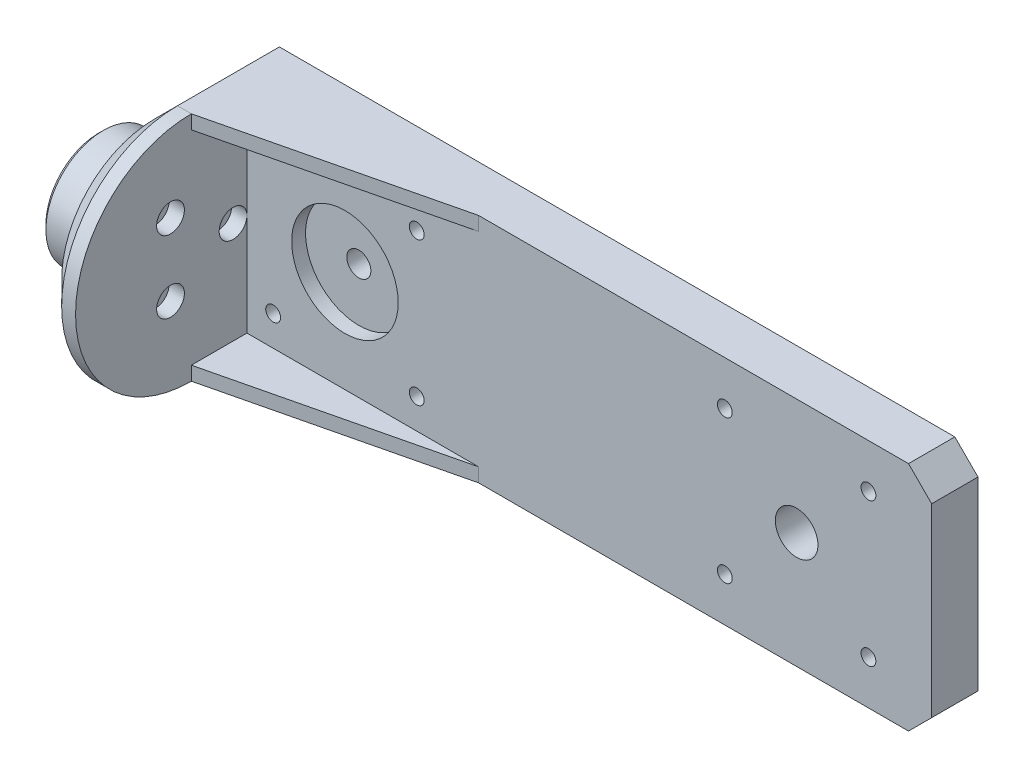
ISO-10303-21;
HEADER;
FILE_DESCRIPTION(('STEP AP214'),'2;1');
FILE_NAME('part.step','',(''),(''),'','','');
FILE_SCHEMA(('AUTOMOTIVE_DESIGN { 1 0 10303 214 1 1 1 1 }'));
ENDSEC;
DATA;
#1=APPLICATION_CONTEXT('core data for automotive mechanical design processes');
#2=APPLICATION_PROTOCOL_DEFINITION('international standard','automotive_design',2000,#1);
#3=PRODUCT_CONTEXT('',#1,'mechanical');
#4=PRODUCT('Part','Part','',(#3));
#5=PRODUCT_RELATED_PRODUCT_CATEGORY('part','',(#4));
#6=PRODUCT_DEFINITION_FORMATION('','',#4);
#7=PRODUCT_DEFINITION_CONTEXT('part definition',#1,'design');
#8=PRODUCT_DEFINITION('design','',#6,#7);
#9=PRODUCT_DEFINITION_SHAPE('','',#8);
#10=(LENGTH_UNIT() NAMED_UNIT(*) SI_UNIT(.MILLI.,.METRE.));
#11=(NAMED_UNIT(*) PLANE_ANGLE_UNIT() SI_UNIT($,.RADIAN.));
#12=(NAMED_UNIT(*) SI_UNIT($,.STERADIAN.) SOLID_ANGLE_UNIT());
#13=UNCERTAINTY_MEASURE_WITH_UNIT(LENGTH_MEASURE(1.E-05),#10,'distance_accuracy_value','');
#14=(GEOMETRIC_REPRESENTATION_CONTEXT(3) GLOBAL_UNCERTAINTY_ASSIGNED_CONTEXT((#13)) GLOBAL_UNIT_ASSIGNED_CONTEXT((#10,
#11,#12)) REPRESENTATION_CONTEXT('',''));
#15=CARTESIAN_POINT('',(0.,0.,0.));
#16=DIRECTION('',(0.,0.,1.));
#17=DIRECTION('',(1.,0.,0.));
#18=AXIS2_PLACEMENT_3D('',#15,#16,#17);
#19=CARTESIAN_POINT('',(41.1500000000002,0.,-22.));
#20=DIRECTION('',(0.,0.,1.));
#21=DIRECTION('',(1.,0.,0.));
#22=AXIS2_PLACEMENT_3D('',#19,#20,#21);
#23=CYLINDRICAL_SURFACE('',#22,2.6);
#24=CARTESIAN_POINT('',(41.1500000000002,0.,-22.));
#25=DIRECTION('',(0.,0.,1.));
#26=DIRECTION('',(1.,0.,0.));
#27=AXIS2_PLACEMENT_3D('',#24,#25,#26);
#28=CIRCLE('',#27,2.6);
#29=CARTESIAN_POINT('',(43.7500000000002,0.,-22.));
#30=VERTEX_POINT('',#29);
#31=EDGE_CURVE('E225',#30,#30,#28,.T.);
#32=ORIENTED_EDGE('',*,*,#31,.F.);
#33=EDGE_LOOP('',(#32));
#34=FACE_BOUND('',#33,.T.);
#35=CARTESIAN_POINT('',(41.1500000000002,0.,-15.));
#36=DIRECTION('',(0.,0.,1.));
#37=DIRECTION('',(1.,0.,0.));
#38=AXIS2_PLACEMENT_3D('',#35,#36,#37);
#39=CIRCLE('',#38,2.6);
#40=CARTESIAN_POINT('',(43.7500000000002,0.,-15.));
#41=VERTEX_POINT('',#40);
#42=EDGE_CURVE('E195',#41,#41,#39,.F.);
#43=ORIENTED_EDGE('',*,*,#42,.F.);
#44=EDGE_LOOP('',(#43));
#45=FACE_BOUND('',#44,.T.);
#46=ADVANCED_FACE('F41',(#34,#45),#23,.F.);
#47=CARTESIAN_POINT('',(20.,0.,-9.00000000000001));
#48=DIRECTION('',(-1.,0.,0.));
#49=DIRECTION('',(0.,0.,1.));
#50=AXIS2_PLACEMENT_3D('',#47,#48,#49);
#51=CYLINDRICAL_SURFACE('',#50,1.59999999999999);
#52=CARTESIAN_POINT('',(0.,0.,-9.00000000000001));
#53=DIRECTION('',(1.,0.,0.));
#54=DIRECTION('',(0.,0.,-1.));
#55=AXIS2_PLACEMENT_3D('',#52,#53,#54);
#56=CIRCLE('',#55,1.59999999999999);
#57=CARTESIAN_POINT('',(0.,0.,-10.6));
#58=VERTEX_POINT('',#57);
#59=EDGE_CURVE('E311',#58,#58,#56,.T.);
#60=ORIENTED_EDGE('',*,*,#59,.F.);
#61=EDGE_LOOP('',(#60));
#62=FACE_BOUND('',#61,.T.);
#63=CARTESIAN_POINT('',(16.7,0.,-9.00000000000001));
#64=DIRECTION('',(1.,0.,0.));
#65=DIRECTION('',(0.,0.,-1.));
#66=AXIS2_PLACEMENT_3D('',#63,#64,#65);
#67=CIRCLE('',#66,1.59999999999999);
#68=CARTESIAN_POINT('',(16.7,0.,-10.6));
#69=VERTEX_POINT('',#68);
#70=EDGE_CURVE('E224',#69,#69,#67,.T.);
#71=ORIENTED_EDGE('',*,*,#70,.T.);
#72=EDGE_LOOP('',(#71));
#73=FACE_BOUND('',#72,.T.);
#74=ADVANCED_FACE('F373',(#62,#73),#51,.F.);
#75=CARTESIAN_POINT('',(20.,-7.79422863405993,4.50000000000004));
#76=DIRECTION('',(-1.,0.,0.));
#77=DIRECTION('',(0.,0.,1.));
#78=AXIS2_PLACEMENT_3D('',#75,#76,#77);
#79=CYLINDRICAL_SURFACE('',#78,1.6);
#80=CARTESIAN_POINT('',(0.,-7.79422863405993,4.50000000000004));
#81=DIRECTION('',(1.,0.,0.));
#82=DIRECTION('',(0.,0.,-1.));
#83=AXIS2_PLACEMENT_3D('',#80,#81,#82);
#84=CIRCLE('',#83,1.6);
#85=CARTESIAN_POINT('',(0.,-7.79422863405993,2.90000000000004));
#86=VERTEX_POINT('',#85);
#87=EDGE_CURVE('E308',#86,#86,#84,.T.);
#88=ORIENTED_EDGE('',*,*,#87,.F.);
#89=EDGE_LOOP('',(#88));
#90=FACE_BOUND('',#89,.T.);
#91=CARTESIAN_POINT('',(16.7,-7.79422863405993,4.50000000000004));
#92=DIRECTION('',(1.,0.,0.));
#93=DIRECTION('',(0.,0.,-1.));
#94=AXIS2_PLACEMENT_3D('',#91,#92,#93);
#95=CIRCLE('',#94,1.6);
#96=CARTESIAN_POINT('',(16.7,-7.79422863405993,2.90000000000004));
#97=VERTEX_POINT('',#96);
#98=EDGE_CURVE('E317',#97,#97,#95,.T.);
#99=ORIENTED_EDGE('',*,*,#98,.T.);
#100=EDGE_LOOP('',(#99));
#101=FACE_BOUND('',#100,.T.);
#102=ADVANCED_FACE('F379',(#90,#101),#79,.F.);
#103=CARTESIAN_POINT('',(20.,7.79422863406,4.49999999999993));
#104=DIRECTION('',(-1.,0.,0.));
#105=DIRECTION('',(0.,0.,1.));
#106=AXIS2_PLACEMENT_3D('',#103,#104,#105);
#107=CYLINDRICAL_SURFACE('',#106,1.6);
#108=CARTESIAN_POINT('',(0.,7.79422863406,4.49999999999993));
#109=DIRECTION('',(1.,0.,0.));
#110=DIRECTION('',(0.,0.,-1.));
#111=AXIS2_PLACEMENT_3D('',#108,#109,#110);
#112=CIRCLE('',#111,1.6);
#113=CARTESIAN_POINT('',(0.,7.79422863406,2.89999999999993));
#114=VERTEX_POINT('',#113);
#115=EDGE_CURVE('E304',#114,#114,#112,.T.);
#116=ORIENTED_EDGE('',*,*,#115,.F.);
#117=EDGE_LOOP('',(#116));
#118=FACE_BOUND('',#117,.T.);
#119=CARTESIAN_POINT('',(16.7,7.79422863406,4.49999999999993));
#120=DIRECTION('',(1.,0.,0.));
#121=DIRECTION('',(0.,0.,-1.));
#122=AXIS2_PLACEMENT_3D('',#119,#120,#121);
#123=CIRCLE('',#122,1.6);
#124=CARTESIAN_POINT('',(16.7,7.79422863406,2.89999999999993));
#125=VERTEX_POINT('',#124);
#126=EDGE_CURVE('E201',#125,#125,#123,.T.);
#127=ORIENTED_EDGE('',*,*,#126,.T.);
#128=EDGE_LOOP('',(#127));
#129=FACE_BOUND('',#128,.T.);
#130=ADVANCED_FACE('F450',(#118,#129),#107,.F.);
#131=CARTESIAN_POINT('',(20.,0.,0.));
#132=DIRECTION('',(-1.,0.,0.));
#133=DIRECTION('',(0.,0.,1.));
#134=AXIS2_PLACEMENT_3D('',#131,#132,#133);
#135=CYLINDRICAL_SURFACE('',#134,12.4);
#136=CARTESIAN_POINT('',(0.99999999999999,0.,0.));
#137=DIRECTION('',(1.,0.,0.));
#138=DIRECTION('',(0.,0.,-1.));
#139=AXIS2_PLACEMENT_3D('',#136,#137,#138);
#140=CIRCLE('',#139,12.4);
#141=CARTESIAN_POINT('',(0.99999999999999,0.,-12.4));
#142=VERTEX_POINT('',#141);
#143=EDGE_CURVE('E50',#142,#142,#140,.T.);
#144=ORIENTED_EDGE('',*,*,#143,.T.);
#145=EDGE_LOOP('',(#144));
#146=FACE_BOUND('',#145,.T.);
#147=CARTESIAN_POINT('',(12.,0.,0.));
#148=DIRECTION('',(1.,0.,0.));
#149=DIRECTION('',(0.,0.,-1.));
#150=AXIS2_PLACEMENT_3D('',#147,#148,#149);
#151=CIRCLE('',#150,12.4);
#152=CARTESIAN_POINT('',(12.,0.,-12.4));
#153=VERTEX_POINT('',#152);
#154=EDGE_CURVE('E295',#153,#153,#151,.T.);
#155=ORIENTED_EDGE('',*,*,#154,.F.);
#156=EDGE_LOOP('',(#155));
#157=FACE_BOUND('',#156,.T.);
#158=ADVANCED_FACE('F361',(#146,#157),#135,.T.);
#159=CARTESIAN_POINT('',(20.,0.,0.));
#160=DIRECTION('',(1.,0.,0.));
#161=DIRECTION('',(0.,0.,-1.));
#162=AXIS2_PLACEMENT_3D('',#159,#160,#161);
#163=PLANE('',#162);
#164=DIRECTION('',(0.,1.,0.));
#165=VECTOR('',#164,1.);
#166=CARTESIAN_POINT('',(20.,22.,0.));
#167=LINE('',#166,#165);
#168=CARTESIAN_POINT('',(20.,22.,0.));
#169=VERTEX_POINT('',#168);
#170=CARTESIAN_POINT('',(20.,25.,0.));
#171=VERTEX_POINT('',#170);
#172=EDGE_CURVE('E142',#169,#171,#167,.T.);
#173=ORIENTED_EDGE('',*,*,#172,.T.);
#174=CARTESIAN_POINT('',(20.,0.,0.));
#175=DIRECTION('',(1.,0.,0.));
#176=DIRECTION('',(0.,0.,-1.));
#177=AXIS2_PLACEMENT_3D('',#174,#175,#176);
#178=CIRCLE('',#177,25.);
#179=CARTESIAN_POINT('',(20.,-25.,0.));
#180=VERTEX_POINT('',#179);
#181=EDGE_CURVE('E289',#171,#180,#178,.T.);
#182=ORIENTED_EDGE('',*,*,#181,.T.);
#183=DIRECTION('',(0.,-1.,0.));
#184=VECTOR('',#183,1.);
#185=CARTESIAN_POINT('',(20.,-22.,0.));
#186=LINE('',#185,#184);
#187=CARTESIAN_POINT('',(20.,-22.,0.));
#188=VERTEX_POINT('',#187);
#189=EDGE_CURVE('E186',#188,#180,#186,.T.);
#190=ORIENTED_EDGE('',*,*,#189,.F.);
#191=DIRECTION('',(0.,0.,-1.));
#192=VECTOR('',#191,1.);
#193=CARTESIAN_POINT('',(20.,-22.,-12.));
#194=LINE('',#193,#192);
#195=CARTESIAN_POINT('',(20.,-22.,-12.));
#196=VERTEX_POINT('',#195);
#197=EDGE_CURVE('E174',#188,#196,#194,.T.);
#198=ORIENTED_EDGE('',*,*,#197,.T.);
#199=DIRECTION('',(0.,-1.,0.));
#200=VECTOR('',#199,1.);
#201=CARTESIAN_POINT('',(20.,0.,-12.));
#202=LINE('',#201,#200);
#203=CARTESIAN_POINT('',(20.,0.,-12.));
#204=VERTEX_POINT('',#203);
#205=EDGE_CURVE('E300',#204,#196,#202,.T.);
#206=ORIENTED_EDGE('',*,*,#205,.F.);
#207=CARTESIAN_POINT('',(20.,0.,-9.00000000000001));
#208=DIRECTION('',(1.,0.,0.));
#209=DIRECTION('',(0.,0.,-1.));
#210=AXIS2_PLACEMENT_3D('',#207,#208,#209);
#211=CIRCLE('',#210,3.);
#212=EDGE_CURVE('E208',#204,#204,#211,.T.);
#213=ORIENTED_EDGE('',*,*,#212,.F.);
#214=CARTESIAN_POINT('',(20.,22.,-12.));
#215=VERTEX_POINT('',#214);
#216=EDGE_CURVE('E166',#215,#204,#202,.T.);
#217=ORIENTED_EDGE('',*,*,#216,.F.);
#218=DIRECTION('',(0.,0.,1.));
#219=VECTOR('',#218,1.);
#220=CARTESIAN_POINT('',(20.,22.,-12.));
#221=LINE('',#220,#219);
#222=EDGE_CURVE('E158',#215,#169,#221,.T.);
#223=ORIENTED_EDGE('',*,*,#222,.T.);
#224=EDGE_LOOP('',(#173,#182,#190,#198,#206,#213,#217,#223));
#225=FACE_BOUND('',#224,.T.);
#226=CARTESIAN_POINT('',(20.,7.79422863406,4.49999999999993));
#227=DIRECTION('',(1.,0.,0.));
#228=DIRECTION('',(0.,0.,-1.));
#229=AXIS2_PLACEMENT_3D('',#226,#227,#228);
#230=CIRCLE('',#229,3.);
#231=CARTESIAN_POINT('',(20.,7.79422863406,1.49999999999993));
#232=VERTEX_POINT('',#231);
#233=EDGE_CURVE('E202',#232,#232,#230,.T.);
#234=ORIENTED_EDGE('',*,*,#233,.F.);
#235=EDGE_LOOP('',(#234));
#236=FACE_BOUND('',#235,.T.);
#237=CARTESIAN_POINT('',(20.,-7.79422863405993,4.50000000000004));
#238=DIRECTION('',(1.,0.,0.));
#239=DIRECTION('',(0.,0.,-1.));
#240=AXIS2_PLACEMENT_3D('',#237,#238,#239);
#241=CIRCLE('',#240,3.);
#242=CARTESIAN_POINT('',(20.,-7.79422863405993,1.50000000000004));
#243=VERTEX_POINT('',#242);
#244=EDGE_CURVE('E214',#243,#243,#241,.T.);
#245=ORIENTED_EDGE('',*,*,#244,.F.);
#246=EDGE_LOOP('',(#245));
#247=FACE_BOUND('',#246,.T.);
#248=ADVANCED_FACE('F163',(#225,#236,#247),#163,.T.);
#249=CARTESIAN_POINT('',(0.,0.,0.));
#250=DIRECTION('',(1.,0.,0.));
#251=DIRECTION('',(0.,0.,-1.));
#252=AXIS2_PLACEMENT_3D('',#249,#250,#251);
#253=PLANE('',#252);
#254=CARTESIAN_POINT('',(0.,0.,0.));
#255=DIRECTION('',(1.,0.,0.));
#256=DIRECTION('',(0.,0.,-1.));
#257=AXIS2_PLACEMENT_3D('',#254,#255,#256);
#258=CIRCLE('',#257,11.4);
#259=CARTESIAN_POINT('',(0.,0.,-11.4));
#260=VERTEX_POINT('',#259);
#261=EDGE_CURVE('E11',#260,#260,#258,.F.);
#262=ORIENTED_EDGE('',*,*,#261,.T.);
#263=EDGE_LOOP('',(#262));
#264=FACE_BOUND('',#263,.T.);
#265=ORIENTED_EDGE('',*,*,#59,.T.);
#266=EDGE_LOOP('',(#265));
#267=FACE_BOUND('',#266,.T.);
#268=ORIENTED_EDGE('',*,*,#87,.T.);
#269=EDGE_LOOP('',(#268));
#270=FACE_BOUND('',#269,.T.);
#271=ORIENTED_EDGE('',*,*,#115,.T.);
#272=EDGE_LOOP('',(#271));
#273=FACE_BOUND('',#272,.T.);
#274=ADVANCED_FACE('F448',(#264,#267,#270,#273),#253,.F.);
#275=CARTESIAN_POINT('',(12.,25.,0.));
#276=DIRECTION('',(0.,-1.,0.));
#277=DIRECTION('',(0.,0.,-1.));
#278=AXIS2_PLACEMENT_3D('',#275,#276,#277);
#279=PLANE('',#278);
#280=DIRECTION('',(1.,0.,0.));
#281=VECTOR('',#280,1.);
#282=CARTESIAN_POINT('',(12.,25.,-22.));
#283=LINE('',#282,#281);
#284=CARTESIAN_POINT('',(17.,25.,-22.));
#285=VERTEX_POINT('',#284);
#286=CARTESIAN_POINT('',(162.81,25.,-22.));
#287=VERTEX_POINT('',#286);
#288=EDGE_CURVE('E279',#285,#287,#283,.T.);
#289=ORIENTED_EDGE('',*,*,#288,.F.);
#290=DIRECTION('',(0.,0.,1.));
#291=VECTOR('',#290,1.);
#292=CARTESIAN_POINT('',(17.,25.,0.));
#293=LINE('',#292,#291);
#294=CARTESIAN_POINT('',(17.,25.,0.));
#295=VERTEX_POINT('',#294);
#296=EDGE_CURVE('E347',#285,#295,#293,.T.);
#297=ORIENTED_EDGE('',*,*,#296,.T.);
#298=DIRECTION('',(1.,0.,0.));
#299=VECTOR('',#298,1.);
#300=CARTESIAN_POINT('',(12.,25.,0.));
#301=LINE('',#300,#299);
#302=EDGE_CURVE('E298',#295,#171,#301,.T.);
#303=ORIENTED_EDGE('',*,*,#302,.T.);
#304=DIRECTION('',(0.972387301980517,0.,-0.233372952475324));
#305=VECTOR('',#304,1.);
#306=CARTESIAN_POINT('',(20.,25.,0.));
#307=LINE('',#306,#305);
#308=CARTESIAN_POINT('',(69.9999999999999,25.,-12.));
#309=VERTEX_POINT('',#308);
#310=EDGE_CURVE('E148',#171,#309,#307,.T.);
#311=ORIENTED_EDGE('',*,*,#310,.T.);
#312=DIRECTION('',(1.,0.,0.));
#313=VECTOR('',#312,1.);
#314=CARTESIAN_POINT('',(12.,25.,-12.));
#315=LINE('',#314,#313);
#316=CARTESIAN_POINT('',(162.81,25.,-12.));
#317=VERTEX_POINT('',#316);
#318=EDGE_CURVE('E273',#309,#317,#315,.T.);
#319=ORIENTED_EDGE('',*,*,#318,.T.);
#320=DIRECTION('',(0.,0.,-1.));
#321=VECTOR('',#320,1.);
#322=CARTESIAN_POINT('',(162.81,25.,0.));
#323=LINE('',#322,#321);
#324=EDGE_CURVE('E345',#317,#287,#323,.T.);
#325=ORIENTED_EDGE('',*,*,#324,.T.);
#326=EDGE_LOOP('',(#289,#297,#303,#311,#319,#325));
#327=FACE_BOUND('',#326,.T.);
#328=ADVANCED_FACE('F441',(#327),#279,.F.);
#329=CARTESIAN_POINT('',(12.,-25.,0.));
#330=DIRECTION('',(0.,1.,0.));
#331=DIRECTION('',(0.,0.,1.));
#332=AXIS2_PLACEMENT_3D('',#329,#330,#331);
#333=PLANE('',#332);
#334=DIRECTION('',(1.,0.,0.));
#335=VECTOR('',#334,1.);
#336=CARTESIAN_POINT('',(12.,-25.,0.));
#337=LINE('',#336,#335);
#338=CARTESIAN_POINT('',(17.,-25.,0.));
#339=VERTEX_POINT('',#338);
#340=EDGE_CURVE('E302',#339,#180,#337,.T.);
#341=ORIENTED_EDGE('',*,*,#340,.F.);
#342=DIRECTION('',(0.,0.,-1.));
#343=VECTOR('',#342,1.);
#344=CARTESIAN_POINT('',(17.,-25.,0.));
#345=LINE('',#344,#343);
#346=CARTESIAN_POINT('',(17.,-25.,-22.));
#347=VERTEX_POINT('',#346);
#348=EDGE_CURVE('E333',#339,#347,#345,.T.);
#349=ORIENTED_EDGE('',*,*,#348,.T.);
#350=DIRECTION('',(-1.,0.,0.));
#351=VECTOR('',#350,1.);
#352=CARTESIAN_POINT('',(12.,-25.,-22.));
#353=LINE('',#352,#351);
#354=CARTESIAN_POINT('',(162.81,-25.,-22.));
#355=VERTEX_POINT('',#354);
#356=EDGE_CURVE('E286',#355,#347,#353,.T.);
#357=ORIENTED_EDGE('',*,*,#356,.F.);
#358=DIRECTION('',(0.,0.,1.));
#359=VECTOR('',#358,1.);
#360=CARTESIAN_POINT('',(162.81,-25.,0.));
#361=LINE('',#360,#359);
#362=CARTESIAN_POINT('',(162.81,-25.,-12.));
#363=VERTEX_POINT('',#362);
#364=EDGE_CURVE('E330',#355,#363,#361,.T.);
#365=ORIENTED_EDGE('',*,*,#364,.T.);
#366=DIRECTION('',(-1.,0.,0.));
#367=VECTOR('',#366,1.);
#368=CARTESIAN_POINT('',(12.,-25.,-12.));
#369=LINE('',#368,#367);
#370=CARTESIAN_POINT('',(70.,-25.,-12.));
#371=VERTEX_POINT('',#370);
#372=EDGE_CURVE('E280',#363,#371,#369,.T.);
#373=ORIENTED_EDGE('',*,*,#372,.T.);
#374=DIRECTION('',(-0.972387301980517,0.,0.233372952475324));
#375=VECTOR('',#374,1.);
#376=CARTESIAN_POINT('',(20.,-25.,0.));
#377=LINE('',#376,#375);
#378=EDGE_CURVE('E172',#371,#180,#377,.T.);
#379=ORIENTED_EDGE('',*,*,#378,.T.);
#380=EDGE_LOOP('',(#341,#349,#357,#365,#373,#379));
#381=FACE_BOUND('',#380,.T.);
#382=ADVANCED_FACE('F438',(#381),#333,.F.);
#383=CARTESIAN_POINT('',(12.,0.,0.));
#384=DIRECTION('',(1.,0.,0.));
#385=DIRECTION('',(0.,0.,-1.));
#386=AXIS2_PLACEMENT_3D('',#383,#384,#385);
#387=CYLINDRICAL_SURFACE('',#386,25.);
#388=ORIENTED_EDGE('',*,*,#302,.F.);
#389=CARTESIAN_POINT('',(17.,0.,0.));
#390=DIRECTION('',(1.,0.,0.));
#391=DIRECTION('',(0.,0.,-1.));
#392=AXIS2_PLACEMENT_3D('',#389,#390,#391);
#393=CIRCLE('',#392,25.);
#394=EDGE_CURVE('E343',#295,#339,#393,.T.);
#395=ORIENTED_EDGE('',*,*,#394,.T.);
#396=ORIENTED_EDGE('',*,*,#340,.T.);
#397=ORIENTED_EDGE('',*,*,#181,.F.);
#398=EDGE_LOOP('',(#388,#395,#396,#397));
#399=FACE_BOUND('',#398,.T.);
#400=ADVANCED_FACE('F436',(#399),#387,.T.);
#401=CARTESIAN_POINT('',(12.,0.,0.));
#402=DIRECTION('',(1.,0.,0.));
#403=DIRECTION('',(0.,0.,-1.));
#404=AXIS2_PLACEMENT_3D('',#401,#402,#403);
#405=PLANE('',#404);
#406=DIRECTION('',(0.,1.,0.));
#407=VECTOR('',#406,1.);
#408=CARTESIAN_POINT('',(12.,-25.,-22.));
#409=LINE('',#408,#407);
#410=CARTESIAN_POINT('',(12.,-20.,-22.));
#411=VERTEX_POINT('',#410);
#412=CARTESIAN_POINT('',(12.,20.,-22.));
#413=VERTEX_POINT('',#412);
#414=EDGE_CURVE('E276',#411,#413,#409,.T.);
#415=ORIENTED_EDGE('',*,*,#414,.F.);
#416=DIRECTION('',(0.,0.,1.));
#417=VECTOR('',#416,1.);
#418=CARTESIAN_POINT('',(12.,-20.,0.));
#419=LINE('',#418,#417);
#420=CARTESIAN_POINT('',(12.,-20.,0.));
#421=VERTEX_POINT('',#420);
#422=EDGE_CURVE('E327',#411,#421,#419,.T.);
#423=ORIENTED_EDGE('',*,*,#422,.T.);
#424=CARTESIAN_POINT('',(12.,0.,0.));
#425=DIRECTION('',(1.,0.,0.));
#426=DIRECTION('',(0.,0.,-1.));
#427=AXIS2_PLACEMENT_3D('',#424,#425,#426);
#428=CIRCLE('',#427,20.);
#429=CARTESIAN_POINT('',(12.,20.,0.));
#430=VERTEX_POINT('',#429);
#431=EDGE_CURVE('E325',#421,#430,#428,.F.);
#432=ORIENTED_EDGE('',*,*,#431,.T.);
#433=DIRECTION('',(0.,0.,-1.));
#434=VECTOR('',#433,1.);
#435=CARTESIAN_POINT('',(12.,20.,0.));
#436=LINE('',#435,#434);
#437=EDGE_CURVE('E314',#430,#413,#436,.T.);
#438=ORIENTED_EDGE('',*,*,#437,.T.);
#439=EDGE_LOOP('',(#415,#423,#432,#438));
#440=FACE_BOUND('',#439,.T.);
#441=ORIENTED_EDGE('',*,*,#154,.T.);
#442=EDGE_LOOP('',(#441));
#443=FACE_BOUND('',#442,.T.);
#444=ADVANCED_FACE('F432',(#440,#443),#405,.F.);
#445=CARTESIAN_POINT('',(167.81,25.,-22.));
#446=DIRECTION('',(-1.,0.,0.));
#447=DIRECTION('',(0.,0.,1.));
#448=AXIS2_PLACEMENT_3D('',#445,#446,#447);
#449=PLANE('',#448);
#450=DIRECTION('',(0.,-1.,0.));
#451=VECTOR('',#450,1.);
#452=CARTESIAN_POINT('',(167.81,25.,-12.));
#453=LINE('',#452,#451);
#454=CARTESIAN_POINT('',(167.81,20.,-12.));
#455=VERTEX_POINT('',#454);
#456=CARTESIAN_POINT('',(167.81,-20.,-12.));
#457=VERTEX_POINT('',#456);
#458=EDGE_CURVE('E292',#455,#457,#453,.T.);
#459=ORIENTED_EDGE('',*,*,#458,.T.);
#460=DIRECTION('',(0.,0.,-1.));
#461=VECTOR('',#460,1.);
#462=CARTESIAN_POINT('',(167.81,-20.,-22.));
#463=LINE('',#462,#461);
#464=CARTESIAN_POINT('',(167.81,-20.,-22.));
#465=VERTEX_POINT('',#464);
#466=EDGE_CURVE('E353',#457,#465,#463,.T.);
#467=ORIENTED_EDGE('',*,*,#466,.T.);
#468=DIRECTION('',(0.,-1.,0.));
#469=VECTOR('',#468,1.);
#470=CARTESIAN_POINT('',(167.81,25.,-22.));
#471=LINE('',#470,#469);
#472=CARTESIAN_POINT('',(167.81,20.,-22.));
#473=VERTEX_POINT('',#472);
#474=EDGE_CURVE('E283',#473,#465,#471,.T.);
#475=ORIENTED_EDGE('',*,*,#474,.F.);
#476=DIRECTION('',(0.,0.,1.));
#477=VECTOR('',#476,1.);
#478=CARTESIAN_POINT('',(167.81,20.,-22.));
#479=LINE('',#478,#477);
#480=EDGE_CURVE('E351',#473,#455,#479,.T.);
#481=ORIENTED_EDGE('',*,*,#480,.T.);
#482=EDGE_LOOP('',(#459,#467,#475,#481));
#483=FACE_BOUND('',#482,.T.);
#484=ADVANCED_FACE('F425',(#483),#449,.F.);
#485=CARTESIAN_POINT('',(0.,0.,-22.));
#486=DIRECTION('',(0.,0.,-1.));
#487=DIRECTION('',(-1.,0.,0.));
#488=AXIS2_PLACEMENT_3D('',#485,#486,#487);
#489=PLANE('',#488);
#490=ORIENTED_EDGE('',*,*,#31,.T.);
#491=EDGE_LOOP('',(#490));
#492=FACE_BOUND('',#491,.T.);
#493=CARTESIAN_POINT('',(56.65,15.5,-22.));
#494=DIRECTION('',(0.,0.,1.));
#495=DIRECTION('',(1.,0.,0.));
#496=AXIS2_PLACEMENT_3D('',#493,#494,#495);
#497=CIRCLE('',#496,1.6);
#498=CARTESIAN_POINT('',(58.25,15.5,-22.));
#499=VERTEX_POINT('',#498);
#500=EDGE_CURVE('E229',#499,#499,#497,.T.);
#501=ORIENTED_EDGE('',*,*,#500,.T.);
#502=EDGE_LOOP('',(#501));
#503=FACE_BOUND('',#502,.T.);
#504=CARTESIAN_POINT('',(56.6500000000003,-15.5,-22.));
#505=DIRECTION('',(0.,0.,1.));
#506=DIRECTION('',(1.,0.,0.));
#507=AXIS2_PLACEMENT_3D('',#504,#505,#506);
#508=CIRCLE('',#507,1.6);
#509=CARTESIAN_POINT('',(58.2500000000003,-15.5,-22.));
#510=VERTEX_POINT('',#509);
#511=EDGE_CURVE('E235',#510,#510,#508,.T.);
#512=ORIENTED_EDGE('',*,*,#511,.T.);
#513=EDGE_LOOP('',(#512));
#514=FACE_BOUND('',#513,.T.);
#515=CARTESIAN_POINT('',(25.6500000000003,-15.5,-22.));
#516=DIRECTION('',(0.,0.,1.));
#517=DIRECTION('',(1.,0.,0.));
#518=AXIS2_PLACEMENT_3D('',#515,#516,#517);
#519=CIRCLE('',#518,1.6);
#520=CARTESIAN_POINT('',(27.2500000000003,-15.5,-22.));
#521=VERTEX_POINT('',#520);
#522=EDGE_CURVE('E241',#521,#521,#519,.T.);
#523=ORIENTED_EDGE('',*,*,#522,.T.);
#524=EDGE_LOOP('',(#523));
#525=FACE_BOUND('',#524,.T.);
#526=CARTESIAN_POINT('',(138.66,0.,-22.));
#527=DIRECTION('',(0.,0.,1.));
#528=DIRECTION('',(1.,0.,0.));
#529=AXIS2_PLACEMENT_3D('',#526,#527,#528);
#530=CIRCLE('',#529,4.59999999999999);
#531=CARTESIAN_POINT('',(143.26,0.,-22.));
#532=VERTEX_POINT('',#531);
#533=EDGE_CURVE('E247',#532,#532,#530,.T.);
#534=ORIENTED_EDGE('',*,*,#533,.T.);
#535=EDGE_LOOP('',(#534));
#536=FACE_BOUND('',#535,.T.);
#537=CARTESIAN_POINT('',(123.16,15.5,-22.));
#538=DIRECTION('',(0.,0.,1.));
#539=DIRECTION('',(1.,0.,0.));
#540=AXIS2_PLACEMENT_3D('',#537,#538,#539);
#541=CIRCLE('',#540,1.6);
#542=CARTESIAN_POINT('',(124.76,15.5,-22.));
#543=VERTEX_POINT('',#542);
#544=EDGE_CURVE('E253',#543,#543,#541,.T.);
#545=ORIENTED_EDGE('',*,*,#544,.T.);
#546=EDGE_LOOP('',(#545));
#547=FACE_BOUND('',#546,.T.);
#548=CARTESIAN_POINT('',(154.16,15.5,-22.));
#549=DIRECTION('',(0.,0.,1.));
#550=DIRECTION('',(1.,0.,0.));
#551=AXIS2_PLACEMENT_3D('',#548,#549,#550);
#552=CIRCLE('',#551,1.59999999999999);
#553=CARTESIAN_POINT('',(155.76,15.5,-22.));
#554=VERTEX_POINT('',#553);
#555=EDGE_CURVE('E259',#554,#554,#552,.T.);
#556=ORIENTED_EDGE('',*,*,#555,.T.);
#557=EDGE_LOOP('',(#556));
#558=FACE_BOUND('',#557,.T.);
#559=CARTESIAN_POINT('',(154.16,-15.5,-22.));
#560=DIRECTION('',(0.,0.,1.));
#561=DIRECTION('',(1.,0.,0.));
#562=AXIS2_PLACEMENT_3D('',#559,#560,#561);
#563=CIRCLE('',#562,1.59999999999999);
#564=CARTESIAN_POINT('',(155.76,-15.5,-22.));
#565=VERTEX_POINT('',#564);
#566=EDGE_CURVE('E265',#565,#565,#563,.T.);
#567=ORIENTED_EDGE('',*,*,#566,.T.);
#568=EDGE_LOOP('',(#567));
#569=FACE_BOUND('',#568,.T.);
#570=CARTESIAN_POINT('',(123.16,-15.5,-22.));
#571=DIRECTION('',(0.,0.,1.));
#572=DIRECTION('',(1.,0.,0.));
#573=AXIS2_PLACEMENT_3D('',#570,#571,#572);
#574=CIRCLE('',#573,1.59999999999999);
#575=CARTESIAN_POINT('',(124.76,-15.5,-22.));
#576=VERTEX_POINT('',#575);
#577=EDGE_CURVE('E217',#576,#576,#574,.T.);
#578=ORIENTED_EDGE('',*,*,#577,.T.);
#579=EDGE_LOOP('',(#578));
#580=FACE_BOUND('',#579,.T.);
#581=CARTESIAN_POINT('',(25.65,15.5,-22.));
#582=DIRECTION('',(0.,0.,1.));
#583=DIRECTION('',(1.,0.,0.));
#584=AXIS2_PLACEMENT_3D('',#581,#582,#583);
#585=CIRCLE('',#584,1.6);
#586=CARTESIAN_POINT('',(27.25,15.5,-22.));
#587=VERTEX_POINT('',#586);
#588=EDGE_CURVE('E270',#587,#587,#585,.T.);
#589=ORIENTED_EDGE('',*,*,#588,.T.);
#590=EDGE_LOOP('',(#589));
#591=FACE_BOUND('',#590,.T.);
#592=ORIENTED_EDGE('',*,*,#356,.T.);
#593=DIRECTION('',(0.707106781186548,-0.707106781186548,0.));
#594=VECTOR('',#593,1.);
#595=CARTESIAN_POINT('',(-3.99999999999998,-3.99999999999998,-22.));
#596=LINE('',#595,#594);
#597=EDGE_CURVE('E341',#347,#411,#596,.F.);
#598=ORIENTED_EDGE('',*,*,#597,.T.);
#599=ORIENTED_EDGE('',*,*,#414,.T.);
#600=DIRECTION('',(-0.707106781186548,-0.707106781186548,0.));
#601=VECTOR('',#600,1.);
#602=CARTESIAN_POINT('',(-3.99999999999998,3.99999999999998,-22.));
#603=LINE('',#602,#601);
#604=EDGE_CURVE('E339',#413,#285,#603,.F.);
#605=ORIENTED_EDGE('',*,*,#604,.T.);
#606=ORIENTED_EDGE('',*,*,#288,.T.);
#607=DIRECTION('',(-0.707106781186547,0.707106781186548,0.));
#608=VECTOR('',#607,1.);
#609=CARTESIAN_POINT('',(93.905,93.905,-22.));
#610=LINE('',#609,#608);
#611=EDGE_CURVE('E335',#287,#473,#610,.F.);
#612=ORIENTED_EDGE('',*,*,#611,.T.);
#613=ORIENTED_EDGE('',*,*,#474,.T.);
#614=DIRECTION('',(0.707106781186545,0.70710678118655,0.));
#615=VECTOR('',#614,1.);
#616=CARTESIAN_POINT('',(93.9050000000005,-93.9049999999999,-22.));
#617=LINE('',#616,#615);
#618=EDGE_CURVE('E337',#465,#355,#617,.F.);
#619=ORIENTED_EDGE('',*,*,#618,.T.);
#620=EDGE_LOOP('',(#592,#598,#599,#605,#606,#612,#613,#619));
#621=FACE_BOUND('',#620,.T.);
#622=ADVANCED_FACE('F422',(#492,#503,#514,#525,#536,#547,#558,#569,#580,#591,#621),#489,.T.);
#623=CARTESIAN_POINT('',(0.,0.,-12.));
#624=DIRECTION('',(0.,0.,-1.));
#625=DIRECTION('',(-1.,0.,0.));
#626=AXIS2_PLACEMENT_3D('',#623,#624,#625);
#627=PLANE('',#626);
#628=CARTESIAN_POINT('',(41.1500000000002,0.,-12.));
#629=DIRECTION('',(0.,0.,1.));
#630=DIRECTION('',(1.,0.,0.));
#631=AXIS2_PLACEMENT_3D('',#628,#629,#630);
#632=CIRCLE('',#631,11.5);
#633=CARTESIAN_POINT('',(52.6500000000002,0.,-12.));
#634=VERTEX_POINT('',#633);
#635=EDGE_CURVE('E189',#634,#634,#632,.T.);
#636=ORIENTED_EDGE('',*,*,#635,.F.);
#637=EDGE_LOOP('',(#636));
#638=FACE_BOUND('',#637,.T.);
#639=CARTESIAN_POINT('',(56.65,15.5,-12.));
#640=DIRECTION('',(0.,0.,1.));
#641=DIRECTION('',(1.,0.,0.));
#642=AXIS2_PLACEMENT_3D('',#639,#640,#641);
#643=CIRCLE('',#642,1.6);
#644=CARTESIAN_POINT('',(58.25,15.5,-12.));
#645=VERTEX_POINT('',#644);
#646=EDGE_CURVE('E232',#645,#645,#643,.T.);
#647=ORIENTED_EDGE('',*,*,#646,.F.);
#648=EDGE_LOOP('',(#647));
#649=FACE_BOUND('',#648,.T.);
#650=CARTESIAN_POINT('',(56.6500000000003,-15.5,-12.));
#651=DIRECTION('',(0.,0.,1.));
#652=DIRECTION('',(1.,0.,0.));
#653=AXIS2_PLACEMENT_3D('',#650,#651,#652);
#654=CIRCLE('',#653,1.6);
#655=CARTESIAN_POINT('',(58.2500000000003,-15.5,-12.));
#656=VERTEX_POINT('',#655);
#657=EDGE_CURVE('E238',#656,#656,#654,.T.);
#658=ORIENTED_EDGE('',*,*,#657,.F.);
#659=EDGE_LOOP('',(#658));
#660=FACE_BOUND('',#659,.T.);
#661=CARTESIAN_POINT('',(25.6500000000003,-15.5,-12.));
#662=DIRECTION('',(0.,0.,1.));
#663=DIRECTION('',(1.,0.,0.));
#664=AXIS2_PLACEMENT_3D('',#661,#662,#663);
#665=CIRCLE('',#664,1.6);
#666=CARTESIAN_POINT('',(27.2500000000003,-15.5,-12.));
#667=VERTEX_POINT('',#666);
#668=EDGE_CURVE('E244',#667,#667,#665,.T.);
#669=ORIENTED_EDGE('',*,*,#668,.F.);
#670=EDGE_LOOP('',(#669));
#671=FACE_BOUND('',#670,.T.);
#672=CARTESIAN_POINT('',(138.66,0.,-12.));
#673=DIRECTION('',(0.,0.,1.));
#674=DIRECTION('',(1.,0.,0.));
#675=AXIS2_PLACEMENT_3D('',#672,#673,#674);
#676=CIRCLE('',#675,4.59999999999999);
#677=CARTESIAN_POINT('',(143.26,0.,-12.));
#678=VERTEX_POINT('',#677);
#679=EDGE_CURVE('E250',#678,#678,#676,.T.);
#680=ORIENTED_EDGE('',*,*,#679,.F.);
#681=EDGE_LOOP('',(#680));
#682=FACE_BOUND('',#681,.T.);
#683=CARTESIAN_POINT('',(123.16,15.5,-12.));
#684=DIRECTION('',(0.,0.,1.));
#685=DIRECTION('',(1.,0.,0.));
#686=AXIS2_PLACEMENT_3D('',#683,#684,#685);
#687=CIRCLE('',#686,1.6);
#688=CARTESIAN_POINT('',(124.76,15.5,-12.));
#689=VERTEX_POINT('',#688);
#690=EDGE_CURVE('E256',#689,#689,#687,.T.);
#691=ORIENTED_EDGE('',*,*,#690,.F.);
#692=EDGE_LOOP('',(#691));
#693=FACE_BOUND('',#692,.T.);
#694=CARTESIAN_POINT('',(154.16,15.5,-12.));
#695=DIRECTION('',(0.,0.,1.));
#696=DIRECTION('',(1.,0.,0.));
#697=AXIS2_PLACEMENT_3D('',#694,#695,#696);
#698=CIRCLE('',#697,1.59999999999999);
#699=CARTESIAN_POINT('',(155.76,15.5,-12.));
#700=VERTEX_POINT('',#699);
#701=EDGE_CURVE('E262',#700,#700,#698,.T.);
#702=ORIENTED_EDGE('',*,*,#701,.F.);
#703=EDGE_LOOP('',(#702));
#704=FACE_BOUND('',#703,.T.);
#705=CARTESIAN_POINT('',(154.16,-15.5,-12.));
#706=DIRECTION('',(0.,0.,1.));
#707=DIRECTION('',(1.,0.,0.));
#708=AXIS2_PLACEMENT_3D('',#705,#706,#707);
#709=CIRCLE('',#708,1.59999999999999);
#710=CARTESIAN_POINT('',(155.76,-15.5,-12.));
#711=VERTEX_POINT('',#710);
#712=EDGE_CURVE('E220',#711,#711,#709,.T.);
#713=ORIENTED_EDGE('',*,*,#712,.F.);
#714=EDGE_LOOP('',(#713));
#715=FACE_BOUND('',#714,.T.);
#716=CARTESIAN_POINT('',(123.16,-15.5,-12.));
#717=DIRECTION('',(0.,0.,1.));
#718=DIRECTION('',(1.,0.,0.));
#719=AXIS2_PLACEMENT_3D('',#716,#717,#718);
#720=CIRCLE('',#719,1.59999999999999);
#721=CARTESIAN_POINT('',(124.76,-15.5,-12.));
#722=VERTEX_POINT('',#721);
#723=EDGE_CURVE('E221',#722,#722,#720,.T.);
#724=ORIENTED_EDGE('',*,*,#723,.F.);
#725=EDGE_LOOP('',(#724));
#726=FACE_BOUND('',#725,.T.);
#727=CARTESIAN_POINT('',(25.65,15.5,-12.));
#728=DIRECTION('',(0.,0.,1.));
#729=DIRECTION('',(1.,0.,0.));
#730=AXIS2_PLACEMENT_3D('',#727,#728,#729);
#731=CIRCLE('',#730,1.6);
#732=CARTESIAN_POINT('',(27.25,15.5,-12.));
#733=VERTEX_POINT('',#732);
#734=EDGE_CURVE('E228',#733,#733,#731,.T.);
#735=ORIENTED_EDGE('',*,*,#734,.F.);
#736=EDGE_LOOP('',(#735));
#737=FACE_BOUND('',#736,.T.);
#738=ORIENTED_EDGE('',*,*,#372,.F.);
#739=DIRECTION('',(-0.707106781186545,-0.70710678118655,0.));
#740=VECTOR('',#739,1.);
#741=CARTESIAN_POINT('',(162.81,-25.,-12.));
#742=LINE('',#741,#740);
#743=EDGE_CURVE('E57',#363,#457,#742,.F.);
#744=ORIENTED_EDGE('',*,*,#743,.T.);
#745=ORIENTED_EDGE('',*,*,#458,.F.);
#746=DIRECTION('',(0.707106781186547,-0.707106781186548,0.));
#747=VECTOR('',#746,1.);
#748=CARTESIAN_POINT('',(167.81,20.,-12.));
#749=LINE('',#748,#747);
#750=EDGE_CURVE('E65',#455,#317,#749,.F.);
#751=ORIENTED_EDGE('',*,*,#750,.T.);
#752=ORIENTED_EDGE('',*,*,#318,.F.);
#753=DIRECTION('',(0.,1.,0.));
#754=VECTOR('',#753,1.);
#755=CARTESIAN_POINT('',(70.,22.,-12.));
#756=LINE('',#755,#754);
#757=CARTESIAN_POINT('',(70.,22.,-12.));
#758=VERTEX_POINT('',#757);
#759=EDGE_CURVE('E153',#758,#309,#756,.T.);
#760=ORIENTED_EDGE('',*,*,#759,.F.);
#761=DIRECTION('',(-1.,0.,0.));
#762=VECTOR('',#761,1.);
#763=CARTESIAN_POINT('',(70.,22.,-12.));
#764=LINE('',#763,#762);
#765=EDGE_CURVE('E154',#758,#215,#764,.T.);
#766=ORIENTED_EDGE('',*,*,#765,.T.);
#767=ORIENTED_EDGE('',*,*,#216,.T.);
#768=ORIENTED_EDGE('',*,*,#205,.T.);
#769=DIRECTION('',(1.,0.,0.));
#770=VECTOR('',#769,1.);
#771=CARTESIAN_POINT('',(70.,-22.,-12.));
#772=LINE('',#771,#770);
#773=CARTESIAN_POINT('',(70.,-22.,-12.));
#774=VERTEX_POINT('',#773);
#775=EDGE_CURVE('E177',#196,#774,#772,.T.);
#776=ORIENTED_EDGE('',*,*,#775,.T.);
#777=DIRECTION('',(0.,-1.,0.));
#778=VECTOR('',#777,1.);
#779=CARTESIAN_POINT('',(70.,-22.,-12.));
#780=LINE('',#779,#778);
#781=EDGE_CURVE('E183',#774,#371,#780,.T.);
#782=ORIENTED_EDGE('',*,*,#781,.T.);
#783=EDGE_LOOP('',(#738,#744,#745,#751,#752,#760,#766,#767,#768,#776,#782));
#784=FACE_BOUND('',#783,.T.);
#785=ADVANCED_FACE('F420',(#638,#649,#660,#671,#682,#693,#704,#715,#726,#737,#784),#627,.F.);
#786=CARTESIAN_POINT('',(25.65,15.5,-22.));
#787=DIRECTION('',(0.,0.,1.));
#788=DIRECTION('',(1.,0.,0.));
#789=AXIS2_PLACEMENT_3D('',#786,#787,#788);
#790=CYLINDRICAL_SURFACE('',#789,1.6);
#791=ORIENTED_EDGE('',*,*,#588,.F.);
#792=EDGE_LOOP('',(#791));
#793=FACE_BOUND('',#792,.T.);
#794=ORIENTED_EDGE('',*,*,#734,.T.);
#795=EDGE_LOOP('',(#794));
#796=FACE_BOUND('',#795,.T.);
#797=ADVANCED_FACE('F417',(#793,#796),#790,.F.);
#798=CARTESIAN_POINT('',(123.16,-15.5,-22.));
#799=DIRECTION('',(0.,0.,1.));
#800=DIRECTION('',(1.,0.,0.));
#801=AXIS2_PLACEMENT_3D('',#798,#799,#800);
#802=CYLINDRICAL_SURFACE('',#801,1.59999999999999);
#803=ORIENTED_EDGE('',*,*,#577,.F.);
#804=EDGE_LOOP('',(#803));
#805=FACE_BOUND('',#804,.T.);
#806=ORIENTED_EDGE('',*,*,#723,.T.);
#807=EDGE_LOOP('',(#806));
#808=FACE_BOUND('',#807,.T.);
#809=ADVANCED_FACE('F386',(#805,#808),#802,.F.);
#810=CARTESIAN_POINT('',(154.16,-15.5,-22.));
#811=DIRECTION('',(0.,0.,1.));
#812=DIRECTION('',(1.,0.,0.));
#813=AXIS2_PLACEMENT_3D('',#810,#811,#812);
#814=CYLINDRICAL_SURFACE('',#813,1.59999999999999);
#815=ORIENTED_EDGE('',*,*,#566,.F.);
#816=EDGE_LOOP('',(#815));
#817=FACE_BOUND('',#816,.T.);
#818=ORIENTED_EDGE('',*,*,#712,.T.);
#819=EDGE_LOOP('',(#818));
#820=FACE_BOUND('',#819,.T.);
#821=ADVANCED_FACE('F412',(#817,#820),#814,.F.);
#822=CARTESIAN_POINT('',(154.16,15.5,-22.));
#823=DIRECTION('',(0.,0.,1.));
#824=DIRECTION('',(1.,0.,0.));
#825=AXIS2_PLACEMENT_3D('',#822,#823,#824);
#826=CYLINDRICAL_SURFACE('',#825,1.59999999999999);
#827=ORIENTED_EDGE('',*,*,#555,.F.);
#828=EDGE_LOOP('',(#827));
#829=FACE_BOUND('',#828,.T.);
#830=ORIENTED_EDGE('',*,*,#701,.T.);
#831=EDGE_LOOP('',(#830));
#832=FACE_BOUND('',#831,.T.);
#833=ADVANCED_FACE('F408',(#829,#832),#826,.F.);
#834=CARTESIAN_POINT('',(123.16,15.5,-22.));
#835=DIRECTION('',(0.,0.,1.));
#836=DIRECTION('',(1.,0.,0.));
#837=AXIS2_PLACEMENT_3D('',#834,#835,#836);
#838=CYLINDRICAL_SURFACE('',#837,1.6);
#839=ORIENTED_EDGE('',*,*,#544,.F.);
#840=EDGE_LOOP('',(#839));
#841=FACE_BOUND('',#840,.T.);
#842=ORIENTED_EDGE('',*,*,#690,.T.);
#843=EDGE_LOOP('',(#842));
#844=FACE_BOUND('',#843,.T.);
#845=ADVANCED_FACE('F404',(#841,#844),#838,.F.);
#846=CARTESIAN_POINT('',(138.66,0.,-22.));
#847=DIRECTION('',(0.,0.,1.));
#848=DIRECTION('',(1.,0.,0.));
#849=AXIS2_PLACEMENT_3D('',#846,#847,#848);
#850=CYLINDRICAL_SURFACE('',#849,4.59999999999999);
#851=ORIENTED_EDGE('',*,*,#533,.F.);
#852=EDGE_LOOP('',(#851));
#853=FACE_BOUND('',#852,.T.);
#854=ORIENTED_EDGE('',*,*,#679,.T.);
#855=EDGE_LOOP('',(#854));
#856=FACE_BOUND('',#855,.T.);
#857=ADVANCED_FACE('F400',(#853,#856),#850,.F.);
#858=CARTESIAN_POINT('',(25.6500000000003,-15.5,-22.));
#859=DIRECTION('',(0.,0.,1.));
#860=DIRECTION('',(1.,0.,0.));
#861=AXIS2_PLACEMENT_3D('',#858,#859,#860);
#862=CYLINDRICAL_SURFACE('',#861,1.6);
#863=ORIENTED_EDGE('',*,*,#522,.F.);
#864=EDGE_LOOP('',(#863));
#865=FACE_BOUND('',#864,.T.);
#866=ORIENTED_EDGE('',*,*,#668,.T.);
#867=EDGE_LOOP('',(#866));
#868=FACE_BOUND('',#867,.T.);
#869=ADVANCED_FACE('F396',(#865,#868),#862,.F.);
#870=CARTESIAN_POINT('',(56.6500000000003,-15.5,-22.));
#871=DIRECTION('',(0.,0.,1.));
#872=DIRECTION('',(1.,0.,0.));
#873=AXIS2_PLACEMENT_3D('',#870,#871,#872);
#874=CYLINDRICAL_SURFACE('',#873,1.6);
#875=ORIENTED_EDGE('',*,*,#511,.F.);
#876=EDGE_LOOP('',(#875));
#877=FACE_BOUND('',#876,.T.);
#878=ORIENTED_EDGE('',*,*,#657,.T.);
#879=EDGE_LOOP('',(#878));
#880=FACE_BOUND('',#879,.T.);
#881=ADVANCED_FACE('F392',(#877,#880),#874,.F.);
#882=CARTESIAN_POINT('',(56.65,15.5,-22.));
#883=DIRECTION('',(0.,0.,1.));
#884=DIRECTION('',(1.,0.,0.));
#885=AXIS2_PLACEMENT_3D('',#882,#883,#884);
#886=CYLINDRICAL_SURFACE('',#885,1.6);
#887=ORIENTED_EDGE('',*,*,#500,.F.);
#888=EDGE_LOOP('',(#887));
#889=FACE_BOUND('',#888,.T.);
#890=ORIENTED_EDGE('',*,*,#646,.T.);
#891=EDGE_LOOP('',(#890));
#892=FACE_BOUND('',#891,.T.);
#893=ADVANCED_FACE('F388',(#889,#892),#886,.F.);
#894=CARTESIAN_POINT('',(16.7,7.79422863406,4.49999999999993));
#895=DIRECTION('',(1.,0.,0.));
#896=DIRECTION('',(0.,0.,-1.));
#897=AXIS2_PLACEMENT_3D('',#894,#895,#896);
#898=CYLINDRICAL_SURFACE('',#897,3.);
#899=CARTESIAN_POINT('',(16.7,7.79422863406,4.49999999999993));
#900=DIRECTION('',(1.,0.,0.));
#901=DIRECTION('',(0.,0.,-1.));
#902=AXIS2_PLACEMENT_3D('',#899,#900,#901);
#903=CIRCLE('',#902,3.);
#904=CARTESIAN_POINT('',(16.7,7.79422863406,1.49999999999993));
#905=VERTEX_POINT('',#904);
#906=EDGE_CURVE('E198',#905,#905,#903,.T.);
#907=ORIENTED_EDGE('',*,*,#906,.F.);
#908=EDGE_LOOP('',(#907));
#909=FACE_BOUND('',#908,.T.);
#910=ORIENTED_EDGE('',*,*,#233,.T.);
#911=EDGE_LOOP('',(#910));
#912=FACE_BOUND('',#911,.T.);
#913=ADVANCED_FACE('F391',(#909,#912),#898,.F.);
#914=CARTESIAN_POINT('',(16.7,7.79422863406,4.49999999999993));
#915=DIRECTION('',(1.,0.,0.));
#916=DIRECTION('',(0.,0.,-1.));
#917=AXIS2_PLACEMENT_3D('',#914,#915,#916);
#918=PLANE('',#917);
#919=ORIENTED_EDGE('',*,*,#126,.F.);
#920=EDGE_LOOP('',(#919));
#921=FACE_BOUND('',#920,.T.);
#922=ORIENTED_EDGE('',*,*,#906,.T.);
#923=EDGE_LOOP('',(#922));
#924=FACE_BOUND('',#923,.T.);
#925=ADVANCED_FACE('F546',(#921,#924),#918,.T.);
#926=CARTESIAN_POINT('',(16.7,-7.79422863405993,4.50000000000004));
#927=DIRECTION('',(1.,0.,0.));
#928=DIRECTION('',(0.,0.,-1.));
#929=AXIS2_PLACEMENT_3D('',#926,#927,#928);
#930=CYLINDRICAL_SURFACE('',#929,3.);
#931=CARTESIAN_POINT('',(16.7,-7.79422863405993,4.50000000000004));
#932=DIRECTION('',(1.,0.,0.));
#933=DIRECTION('',(0.,0.,-1.));
#934=AXIS2_PLACEMENT_3D('',#931,#932,#933);
#935=CIRCLE('',#934,3.);
#936=CARTESIAN_POINT('',(16.7,-7.79422863405993,1.50000000000004));
#937=VERTEX_POINT('',#936);
#938=EDGE_CURVE('E211',#937,#937,#935,.T.);
#939=ORIENTED_EDGE('',*,*,#938,.F.);
#940=EDGE_LOOP('',(#939));
#941=FACE_BOUND('',#940,.T.);
#942=ORIENTED_EDGE('',*,*,#244,.T.);
#943=EDGE_LOOP('',(#942));
#944=FACE_BOUND('',#943,.T.);
#945=ADVANCED_FACE('F549',(#941,#944),#930,.F.);
#946=CARTESIAN_POINT('',(16.7,-7.79422863405993,4.50000000000004));
#947=DIRECTION('',(1.,0.,0.));
#948=DIRECTION('',(0.,0.,-1.));
#949=AXIS2_PLACEMENT_3D('',#946,#947,#948);
#950=PLANE('',#949);
#951=ORIENTED_EDGE('',*,*,#98,.F.);
#952=EDGE_LOOP('',(#951));
#953=FACE_BOUND('',#952,.T.);
#954=ORIENTED_EDGE('',*,*,#938,.T.);
#955=EDGE_LOOP('',(#954));
#956=FACE_BOUND('',#955,.T.);
#957=ADVANCED_FACE('F560',(#953,#956),#950,.T.);
#958=CARTESIAN_POINT('',(16.7,0.,-9.00000000000001));
#959=DIRECTION('',(1.,0.,0.));
#960=DIRECTION('',(0.,0.,-1.));
#961=AXIS2_PLACEMENT_3D('',#958,#959,#960);
#962=CYLINDRICAL_SURFACE('',#961,3.);
#963=CARTESIAN_POINT('',(16.7,0.,-9.00000000000001));
#964=DIRECTION('',(1.,0.,0.));
#965=DIRECTION('',(0.,0.,-1.));
#966=AXIS2_PLACEMENT_3D('',#963,#964,#965);
#967=CIRCLE('',#966,3.);
#968=CARTESIAN_POINT('',(16.7,0.,-12.));
#969=VERTEX_POINT('',#968);
#970=EDGE_CURVE('E205',#969,#969,#967,.T.);
#971=ORIENTED_EDGE('',*,*,#970,.F.);
#972=EDGE_LOOP('',(#971));
#973=FACE_BOUND('',#972,.T.);
#974=ORIENTED_EDGE('',*,*,#212,.T.);
#975=EDGE_LOOP('',(#974));
#976=FACE_BOUND('',#975,.T.);
#977=ADVANCED_FACE('F556',(#973,#976),#962,.F.);
#978=CARTESIAN_POINT('',(16.7,0.,-9.00000000000001));
#979=DIRECTION('',(1.,0.,0.));
#980=DIRECTION('',(0.,0.,-1.));
#981=AXIS2_PLACEMENT_3D('',#978,#979,#980);
#982=PLANE('',#981);
#983=ORIENTED_EDGE('',*,*,#70,.F.);
#984=EDGE_LOOP('',(#983));
#985=FACE_BOUND('',#984,.T.);
#986=ORIENTED_EDGE('',*,*,#970,.T.);
#987=EDGE_LOOP('',(#986));
#988=FACE_BOUND('',#987,.T.);
#989=ADVANCED_FACE('F541',(#985,#988),#982,.T.);
#990=CARTESIAN_POINT('',(41.1500000000002,0.,-15.));
#991=DIRECTION('',(0.,0.,1.));
#992=DIRECTION('',(1.,0.,0.));
#993=AXIS2_PLACEMENT_3D('',#990,#991,#992);
#994=PLANE('',#993);
#995=CARTESIAN_POINT('',(41.1500000000002,0.,-15.));
#996=DIRECTION('',(0.,0.,1.));
#997=DIRECTION('',(1.,0.,0.));
#998=AXIS2_PLACEMENT_3D('',#995,#996,#997);
#999=CIRCLE('',#998,11.5);
#1000=CARTESIAN_POINT('',(52.6500000000002,0.,-15.));
#1001=VERTEX_POINT('',#1000);
#1002=EDGE_CURVE('E192',#1001,#1001,#999,.T.);
#1003=ORIENTED_EDGE('',*,*,#1002,.T.);
#1004=EDGE_LOOP('',(#1003));
#1005=FACE_BOUND('',#1004,.T.);
#1006=ORIENTED_EDGE('',*,*,#42,.T.);
#1007=EDGE_LOOP('',(#1006));
#1008=FACE_BOUND('',#1007,.T.);
#1009=ADVANCED_FACE('F538',(#1005,#1008),#994,.T.);
#1010=CARTESIAN_POINT('',(41.1500000000002,0.,-15.));
#1011=DIRECTION('',(0.,0.,1.));
#1012=DIRECTION('',(1.,0.,0.));
#1013=AXIS2_PLACEMENT_3D('',#1010,#1011,#1012);
#1014=CYLINDRICAL_SURFACE('',#1013,11.5);
#1015=ORIENTED_EDGE('',*,*,#1002,.F.);
#1016=EDGE_LOOP('',(#1015));
#1017=FACE_BOUND('',#1016,.T.);
#1018=ORIENTED_EDGE('',*,*,#635,.T.);
#1019=EDGE_LOOP('',(#1018));
#1020=FACE_BOUND('',#1019,.T.);
#1021=ADVANCED_FACE('F534',(#1017,#1020),#1014,.F.);
#1022=CARTESIAN_POINT('',(20.,-22.,0.));
#1023=DIRECTION('',(0.233372952475324,0.,0.972387301980517));
#1024=DIRECTION('',(0.972387301980518,0.,-0.233372952475324));
#1025=AXIS2_PLACEMENT_3D('',#1022,#1023,#1024);
#1026=PLANE('',#1025);
#1027=ORIENTED_EDGE('',*,*,#378,.F.);
#1028=ORIENTED_EDGE('',*,*,#781,.F.);
#1029=DIRECTION('',(-0.972387301980517,0.,0.233372952475324));
#1030=VECTOR('',#1029,1.);
#1031=CARTESIAN_POINT('',(20.,-22.,0.));
#1032=LINE('',#1031,#1030);
#1033=EDGE_CURVE('E180',#774,#188,#1032,.T.);
#1034=ORIENTED_EDGE('',*,*,#1033,.T.);
#1035=ORIENTED_EDGE('',*,*,#189,.T.);
#1036=EDGE_LOOP('',(#1027,#1028,#1034,#1035));
#1037=FACE_BOUND('',#1036,.T.);
#1038=ADVANCED_FACE('F523',(#1037),#1026,.T.);
#1039=CARTESIAN_POINT('',(0.,-22.,0.));
#1040=DIRECTION('',(0.,-1.,0.));
#1041=DIRECTION('',(0.,0.,-1.));
#1042=AXIS2_PLACEMENT_3D('',#1039,#1040,#1041);
#1043=PLANE('',#1042);
#1044=ORIENTED_EDGE('',*,*,#197,.F.);
#1045=ORIENTED_EDGE('',*,*,#1033,.F.);
#1046=ORIENTED_EDGE('',*,*,#775,.F.);
#1047=EDGE_LOOP('',(#1044,#1045,#1046));
#1048=FACE_BOUND('',#1047,.T.);
#1049=ADVANCED_FACE('F526',(#1048),#1043,.F.);
#1050=CARTESIAN_POINT('',(20.,22.,0.));
#1051=DIRECTION('',(0.233372952475324,0.,0.972387301980517));
#1052=DIRECTION('',(0.972387301980518,0.,-0.233372952475324));
#1053=AXIS2_PLACEMENT_3D('',#1050,#1051,#1052);
#1054=PLANE('',#1053);
#1055=ORIENTED_EDGE('',*,*,#310,.F.);
#1056=ORIENTED_EDGE('',*,*,#172,.F.);
#1057=DIRECTION('',(0.972387301980517,0.,-0.233372952475324));
#1058=VECTOR('',#1057,1.);
#1059=CARTESIAN_POINT('',(20.,22.,0.));
#1060=LINE('',#1059,#1058);
#1061=EDGE_CURVE('E146',#169,#758,#1060,.T.);
#1062=ORIENTED_EDGE('',*,*,#1061,.T.);
#1063=ORIENTED_EDGE('',*,*,#759,.T.);
#1064=EDGE_LOOP('',(#1055,#1056,#1062,#1063));
#1065=FACE_BOUND('',#1064,.T.);
#1066=ADVANCED_FACE('F144',(#1065),#1054,.T.);
#1067=CARTESIAN_POINT('',(0.,22.,0.));
#1068=DIRECTION('',(0.,-1.,0.));
#1069=DIRECTION('',(0.,0.,-1.));
#1070=AXIS2_PLACEMENT_3D('',#1067,#1068,#1069);
#1071=PLANE('',#1070);
#1072=ORIENTED_EDGE('',*,*,#222,.F.);
#1073=ORIENTED_EDGE('',*,*,#765,.F.);
#1074=ORIENTED_EDGE('',*,*,#1061,.F.);
#1075=EDGE_LOOP('',(#1072,#1073,#1074));
#1076=FACE_BOUND('',#1075,.T.);
#1077=ADVANCED_FACE('F157',(#1076),#1071,.T.);
#1078=CARTESIAN_POINT('',(12.,20.,0.));
#1079=DIRECTION('',(0.707106781186547,-0.707106781186547,0.));
#1080=DIRECTION('',(0.,0.,-1.));
#1081=AXIS2_PLACEMENT_3D('',#1078,#1079,#1080);
#1082=PLANE('',#1081);
#1083=ORIENTED_EDGE('',*,*,#604,.F.);
#1084=ORIENTED_EDGE('',*,*,#437,.F.);
#1085=DIRECTION('',(-0.707106781186547,-0.707106781186547,0.));
#1086=VECTOR('',#1085,1.);
#1087=CARTESIAN_POINT('',(17.,25.,0.));
#1088=LINE('',#1087,#1086);
#1089=EDGE_CURVE('E168',#295,#430,#1088,.T.);
#1090=ORIENTED_EDGE('',*,*,#1089,.F.);
#1091=ORIENTED_EDGE('',*,*,#296,.F.);
#1092=EDGE_LOOP('',(#1083,#1084,#1090,#1091));
#1093=FACE_BOUND('',#1092,.T.);
#1094=ADVANCED_FACE('F479',(#1093),#1082,.F.);
#1095=CARTESIAN_POINT('',(17.,0.,0.));
#1096=DIRECTION('',(1.,0.,0.));
#1097=DIRECTION('',(0.,0.,-1.));
#1098=AXIS2_PLACEMENT_3D('',#1095,#1096,#1097);
#1099=CONICAL_SURFACE('',#1098,25.,0.785398163397448);
#1100=ORIENTED_EDGE('',*,*,#1089,.T.);
#1101=ORIENTED_EDGE('',*,*,#431,.F.);
#1102=DIRECTION('',(-0.707106781186547,0.707106781186547,0.));
#1103=VECTOR('',#1102,1.);
#1104=CARTESIAN_POINT('',(17.,-25.,0.));
#1105=LINE('',#1104,#1103);
#1106=EDGE_CURVE('E355',#339,#421,#1105,.T.);
#1107=ORIENTED_EDGE('',*,*,#1106,.F.);
#1108=ORIENTED_EDGE('',*,*,#394,.F.);
#1109=EDGE_LOOP('',(#1100,#1101,#1107,#1108));
#1110=FACE_BOUND('',#1109,.T.);
#1111=ADVANCED_FACE('F472',(#1110),#1099,.T.);
#1112=CARTESIAN_POINT('',(12.,-20.,0.));
#1113=DIRECTION('',(0.707106781186547,0.707106781186547,0.));
#1114=DIRECTION('',(0.,0.,1.));
#1115=AXIS2_PLACEMENT_3D('',#1112,#1113,#1114);
#1116=PLANE('',#1115);
#1117=ORIENTED_EDGE('',*,*,#597,.F.);
#1118=ORIENTED_EDGE('',*,*,#348,.F.);
#1119=ORIENTED_EDGE('',*,*,#1106,.T.);
#1120=ORIENTED_EDGE('',*,*,#422,.F.);
#1121=EDGE_LOOP('',(#1117,#1118,#1119,#1120));
#1122=FACE_BOUND('',#1121,.T.);
#1123=ADVANCED_FACE('F465',(#1122),#1116,.F.);
#1124=CARTESIAN_POINT('',(162.81,-25.,0.));
#1125=DIRECTION('',(-0.70710678118655,0.707106781186545,0.));
#1126=DIRECTION('',(0.,0.,1.));
#1127=AXIS2_PLACEMENT_3D('',#1124,#1125,#1126);
#1128=PLANE('',#1127);
#1129=ORIENTED_EDGE('',*,*,#618,.F.);
#1130=ORIENTED_EDGE('',*,*,#466,.F.);
#1131=ORIENTED_EDGE('',*,*,#743,.F.);
#1132=ORIENTED_EDGE('',*,*,#364,.F.);
#1133=EDGE_LOOP('',(#1129,#1130,#1131,#1132));
#1134=FACE_BOUND('',#1133,.T.);
#1135=ADVANCED_FACE('F370',(#1134),#1128,.F.);
#1136=CARTESIAN_POINT('',(167.81,20.,-22.));
#1137=DIRECTION('',(-0.707106781186548,-0.707106781186547,0.));
#1138=DIRECTION('',(0.,0.,1.));
#1139=AXIS2_PLACEMENT_3D('',#1136,#1137,#1138);
#1140=PLANE('',#1139);
#1141=ORIENTED_EDGE('',*,*,#611,.F.);
#1142=ORIENTED_EDGE('',*,*,#324,.F.);
#1143=ORIENTED_EDGE('',*,*,#750,.F.);
#1144=ORIENTED_EDGE('',*,*,#480,.F.);
#1145=EDGE_LOOP('',(#1141,#1142,#1143,#1144));
#1146=FACE_BOUND('',#1145,.T.);
#1147=ADVANCED_FACE('F365',(#1146),#1140,.F.);
#1148=CARTESIAN_POINT('',(0.99999999999999,0.,0.));
#1149=DIRECTION('',(1.,0.,0.));
#1150=DIRECTION('',(0.,0.,-1.));
#1151=AXIS2_PLACEMENT_3D('',#1148,#1149,#1150);
#1152=CONICAL_SURFACE('',#1151,12.4,0.785398163397449);
#1153=ORIENTED_EDGE('',*,*,#261,.F.);
#1154=EDGE_LOOP('',(#1153));
#1155=FACE_BOUND('',#1154,.T.);
#1156=ORIENTED_EDGE('',*,*,#143,.F.);
#1157=EDGE_LOOP('',(#1156));
#1158=FACE_BOUND('',#1157,.T.);
#1159=ADVANCED_FACE('F44',(#1155,#1158),#1152,.T.);
#1160=CLOSED_SHELL('',(#46,#74,#102,#130,#158,#248,#274,#328,#382,#400,#444,#484,#622,#785,#797,
#809,#821,#833,#845,#857,#869,#881,#893,#913,#925,#945,#957,#977,#989,#1009,#1021,#1038,#1049,
#1066,#1077,#1094,#1111,#1123,#1135,#1147,#1159));
#1161=MANIFOLD_SOLID_BREP('B2',#1160);
#1162=ADVANCED_BREP_SHAPE_REPRESENTATION('',(#18,#1161),#14);
#1163=SHAPE_DEFINITION_REPRESENTATION(#9,#1162);
ENDSEC;
END-ISO-10303-21;
